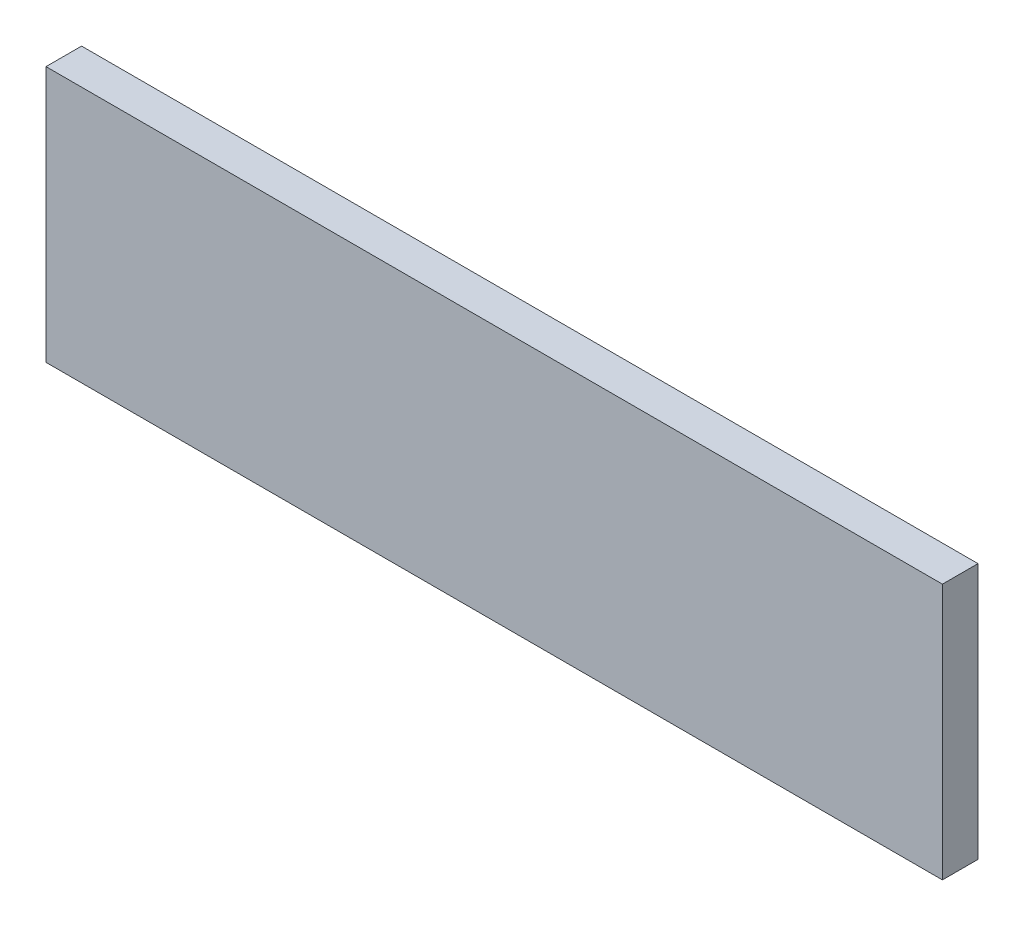
ISO-10303-21;
HEADER;
FILE_DESCRIPTION(('STEP AP214'),'2;1');
FILE_NAME('part.step','',(''),(''),'','','');
FILE_SCHEMA(('AUTOMOTIVE_DESIGN { 1 0 10303 214 1 1 1 1 }'));
ENDSEC;
DATA;
#1=APPLICATION_CONTEXT('core data for automotive mechanical design processes');
#2=APPLICATION_PROTOCOL_DEFINITION('international standard','automotive_design',2000,#1);
#3=PRODUCT_CONTEXT('',#1,'mechanical');
#4=PRODUCT('Part','Part','',(#3));
#5=PRODUCT_RELATED_PRODUCT_CATEGORY('part','',(#4));
#6=PRODUCT_DEFINITION_FORMATION('','',#4);
#7=PRODUCT_DEFINITION_CONTEXT('part definition',#1,'design');
#8=PRODUCT_DEFINITION('design','',#6,#7);
#9=PRODUCT_DEFINITION_SHAPE('','',#8);
#10=(LENGTH_UNIT() NAMED_UNIT(*) SI_UNIT(.MILLI.,.METRE.));
#11=(NAMED_UNIT(*) PLANE_ANGLE_UNIT() SI_UNIT($,.RADIAN.));
#12=(NAMED_UNIT(*) SI_UNIT($,.STERADIAN.) SOLID_ANGLE_UNIT());
#13=UNCERTAINTY_MEASURE_WITH_UNIT(LENGTH_MEASURE(1.E-05),#10,'distance_accuracy_value','');
#14=(GEOMETRIC_REPRESENTATION_CONTEXT(3) GLOBAL_UNCERTAINTY_ASSIGNED_CONTEXT((#13)) GLOBAL_UNIT_ASSIGNED_CONTEXT((#10,
#11,#12)) REPRESENTATION_CONTEXT('',''));
#15=CARTESIAN_POINT('',(0.,0.,0.));
#16=DIRECTION('',(0.,0.,1.));
#17=DIRECTION('',(1.,0.,0.));
#18=AXIS2_PLACEMENT_3D('',#15,#16,#17);
#19=CARTESIAN_POINT('',(-64.862738222395,12.0429188230505,1.5875));
#20=DIRECTION('',(1.,0.,0.));
#21=DIRECTION('',(0.,0.,-1.));
#22=AXIS2_PLACEMENT_3D('',#19,#20,#21);
#23=PLANE('',#22);
#24=DIRECTION('',(0.,-1.,0.));
#25=VECTOR('',#24,1.);
#26=CARTESIAN_POINT('',(-64.862738222395,12.0429188230505,0.));
#27=LINE('',#26,#25);
#28=CARTESIAN_POINT('',(-64.862738222395,12.0429188230505,0.));
#29=VERTEX_POINT('',#28);
#30=CARTESIAN_POINT('',(-64.862738222395,0.612918823050545,0.));
#31=VERTEX_POINT('',#30);
#32=EDGE_CURVE('E96',#29,#31,#27,.T.);
#33=ORIENTED_EDGE('',*,*,#32,.T.);
#34=DIRECTION('',(0.,0.,-1.));
#35=VECTOR('',#34,1.);
#36=CARTESIAN_POINT('',(-64.862738222395,0.612918823050545,1.5875));
#37=LINE('',#36,#35);
#38=CARTESIAN_POINT('',(-64.862738222395,0.612918823050545,1.5875));
#39=VERTEX_POINT('',#38);
#40=EDGE_CURVE('E11',#39,#31,#37,.T.);
#41=ORIENTED_EDGE('',*,*,#40,.F.);
#42=DIRECTION('',(0.,-1.,0.));
#43=VECTOR('',#42,1.);
#44=CARTESIAN_POINT('',(-64.862738222395,12.0429188230505,1.5875));
#45=LINE('',#44,#43);
#46=CARTESIAN_POINT('',(-64.862738222395,12.0429188230505,1.5875));
#47=VERTEX_POINT('',#46);
#48=EDGE_CURVE('E84',#47,#39,#45,.T.);
#49=ORIENTED_EDGE('',*,*,#48,.F.);
#50=DIRECTION('',(0.,0.,-1.));
#51=VECTOR('',#50,1.);
#52=CARTESIAN_POINT('',(-64.862738222395,12.0429188230505,1.5875));
#53=LINE('',#52,#51);
#54=EDGE_CURVE('E92',#47,#29,#53,.T.);
#55=ORIENTED_EDGE('',*,*,#54,.T.);
#56=EDGE_LOOP('',(#33,#41,#49,#55));
#57=FACE_BOUND('',#56,.T.);
#58=ADVANCED_FACE('F33',(#57),#23,.F.);
#59=CARTESIAN_POINT('',(-64.862738222395,0.612918823050545,1.5875));
#60=DIRECTION('',(0.,1.,0.));
#61=DIRECTION('',(0.,0.,1.));
#62=AXIS2_PLACEMENT_3D('',#59,#60,#61);
#63=PLANE('',#62);
#64=DIRECTION('',(1.,0.,0.));
#65=VECTOR('',#64,1.);
#66=CARTESIAN_POINT('',(-64.862738222395,0.612918823050545,0.));
#67=LINE('',#66,#65);
#68=CARTESIAN_POINT('',(-24.862738222395,0.612918823050545,0.));
#69=VERTEX_POINT('',#68);
#70=EDGE_CURVE('E88',#31,#69,#67,.T.);
#71=ORIENTED_EDGE('',*,*,#70,.T.);
#72=DIRECTION('',(0.,0.,-1.));
#73=VECTOR('',#72,1.);
#74=CARTESIAN_POINT('',(-24.862738222395,0.612918823050545,1.5875));
#75=LINE('',#74,#73);
#76=CARTESIAN_POINT('',(-24.862738222395,0.612918823050545,1.5875));
#77=VERTEX_POINT('',#76);
#78=EDGE_CURVE('E41',#77,#69,#75,.T.);
#79=ORIENTED_EDGE('',*,*,#78,.F.);
#80=DIRECTION('',(1.,0.,0.));
#81=VECTOR('',#80,1.);
#82=CARTESIAN_POINT('',(-64.862738222395,0.612918823050545,1.5875));
#83=LINE('',#82,#81);
#84=EDGE_CURVE('E79',#39,#77,#83,.T.);
#85=ORIENTED_EDGE('',*,*,#84,.F.);
#86=ORIENTED_EDGE('',*,*,#40,.T.);
#87=EDGE_LOOP('',(#71,#79,#85,#86));
#88=FACE_BOUND('',#87,.T.);
#89=ADVANCED_FACE('F87',(#88),#63,.F.);
#90=CARTESIAN_POINT('',(-24.862738222395,12.0429188230505,1.5875));
#91=DIRECTION('',(-1.,0.,0.));
#92=DIRECTION('',(0.,-1.,0.));
#93=AXIS2_PLACEMENT_3D('',#90,#91,#92);
#94=PLANE('',#93);
#95=DIRECTION('',(0.,1.,0.));
#96=VECTOR('',#95,1.);
#97=CARTESIAN_POINT('',(-24.862738222395,12.0429188230505,0.));
#98=LINE('',#97,#96);
#99=CARTESIAN_POINT('',(-24.862738222395,12.0429188230505,0.));
#100=VERTEX_POINT('',#99);
#101=EDGE_CURVE('E66',#69,#100,#98,.T.);
#102=ORIENTED_EDGE('',*,*,#101,.T.);
#103=DIRECTION('',(0.,0.,-1.));
#104=VECTOR('',#103,1.);
#105=CARTESIAN_POINT('',(-24.862738222395,12.0429188230505,1.5875));
#106=LINE('',#105,#104);
#107=CARTESIAN_POINT('',(-24.862738222395,12.0429188230505,1.5875));
#108=VERTEX_POINT('',#107);
#109=EDGE_CURVE('E89',#108,#100,#106,.T.);
#110=ORIENTED_EDGE('',*,*,#109,.F.);
#111=DIRECTION('',(0.,1.,0.));
#112=VECTOR('',#111,1.);
#113=CARTESIAN_POINT('',(-24.862738222395,12.0429188230505,1.5875));
#114=LINE('',#113,#112);
#115=EDGE_CURVE('E82',#77,#108,#114,.T.);
#116=ORIENTED_EDGE('',*,*,#115,.F.);
#117=ORIENTED_EDGE('',*,*,#78,.T.);
#118=EDGE_LOOP('',(#102,#110,#116,#117));
#119=FACE_BOUND('',#118,.T.);
#120=ADVANCED_FACE('F90',(#119),#94,.F.);
#121=CARTESIAN_POINT('',(-64.862738222395,12.0429188230505,1.5875));
#122=DIRECTION('',(0.,-1.,0.));
#123=DIRECTION('',(0.,0.,-1.));
#124=AXIS2_PLACEMENT_3D('',#121,#122,#123);
#125=PLANE('',#124);
#126=DIRECTION('',(-1.,0.,0.));
#127=VECTOR('',#126,1.);
#128=CARTESIAN_POINT('',(-64.862738222395,12.0429188230505,0.));
#129=LINE('',#128,#127);
#130=EDGE_CURVE('E72',#100,#29,#129,.T.);
#131=ORIENTED_EDGE('',*,*,#130,.T.);
#132=ORIENTED_EDGE('',*,*,#54,.F.);
#133=DIRECTION('',(-1.,0.,0.));
#134=VECTOR('',#133,1.);
#135=CARTESIAN_POINT('',(-64.862738222395,12.0429188230505,1.5875));
#136=LINE('',#135,#134);
#137=EDGE_CURVE('E49',#108,#47,#136,.T.);
#138=ORIENTED_EDGE('',*,*,#137,.F.);
#139=ORIENTED_EDGE('',*,*,#109,.T.);
#140=EDGE_LOOP('',(#131,#132,#138,#139));
#141=FACE_BOUND('',#140,.T.);
#142=ADVANCED_FACE('F103',(#141),#125,.F.);
#143=CARTESIAN_POINT('',(-64.862738222395,0.612918823050545,1.5875));
#144=DIRECTION('',(0.,0.,1.));
#145=DIRECTION('',(1.,0.,0.));
#146=AXIS2_PLACEMENT_3D('',#143,#144,#145);
#147=PLANE('',#146);
#148=ORIENTED_EDGE('',*,*,#48,.T.);
#149=ORIENTED_EDGE('',*,*,#84,.T.);
#150=ORIENTED_EDGE('',*,*,#115,.T.);
#151=ORIENTED_EDGE('',*,*,#137,.T.);
#152=EDGE_LOOP('',(#148,#149,#150,#151));
#153=FACE_BOUND('',#152,.T.);
#154=ADVANCED_FACE('F80',(#153),#147,.T.);
#155=CARTESIAN_POINT('',(-64.862738222395,0.612918823050545,0.));
#156=DIRECTION('',(0.,0.,1.));
#157=DIRECTION('',(1.,0.,0.));
#158=AXIS2_PLACEMENT_3D('',#155,#156,#157);
#159=PLANE('',#158);
#160=ORIENTED_EDGE('',*,*,#32,.F.);
#161=ORIENTED_EDGE('',*,*,#130,.F.);
#162=ORIENTED_EDGE('',*,*,#101,.F.);
#163=ORIENTED_EDGE('',*,*,#70,.F.);
#164=EDGE_LOOP('',(#160,#161,#162,#163));
#165=FACE_BOUND('',#164,.T.);
#166=ADVANCED_FACE('F106',(#165),#159,.F.);
#167=CLOSED_SHELL('',(#58,#89,#120,#142,#154,#166));
#168=MANIFOLD_SOLID_BREP('B2',#167);
#169=ADVANCED_BREP_SHAPE_REPRESENTATION('',(#18,#168),#14);
#170=SHAPE_DEFINITION_REPRESENTATION(#9,#169);
ENDSEC;
END-ISO-10303-21;
